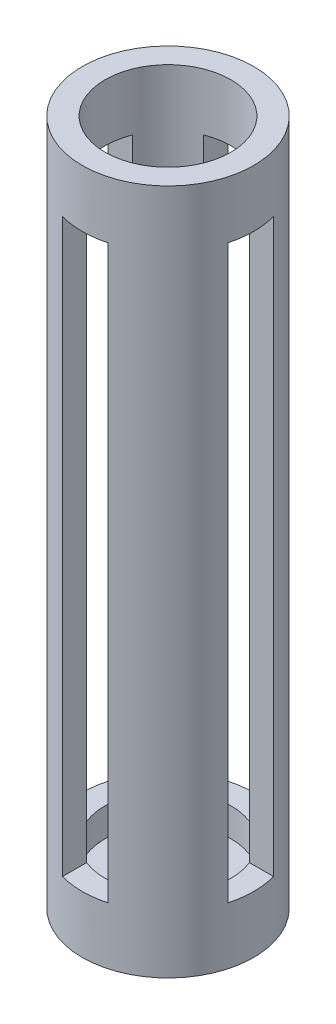
ISO-10303-21;
HEADER;
FILE_DESCRIPTION(('STEP AP214'),'2;1');
FILE_NAME('part.step','',(''),(''),'','','');
FILE_SCHEMA(('AUTOMOTIVE_DESIGN { 1 0 10303 214 1 1 1 1 }'));
ENDSEC;
DATA;
#1=APPLICATION_CONTEXT('core data for automotive mechanical design processes');
#2=APPLICATION_PROTOCOL_DEFINITION('international standard','automotive_design',2000,#1);
#3=PRODUCT_CONTEXT('',#1,'mechanical');
#4=PRODUCT('Part','Part','',(#3));
#5=PRODUCT_RELATED_PRODUCT_CATEGORY('part','',(#4));
#6=PRODUCT_DEFINITION_FORMATION('','',#4);
#7=PRODUCT_DEFINITION_CONTEXT('part definition',#1,'design');
#8=PRODUCT_DEFINITION('design','',#6,#7);
#9=PRODUCT_DEFINITION_SHAPE('','',#8);
#10=(LENGTH_UNIT() NAMED_UNIT(*) SI_UNIT(.MILLI.,.METRE.));
#11=(NAMED_UNIT(*) PLANE_ANGLE_UNIT() SI_UNIT($,.RADIAN.));
#12=(NAMED_UNIT(*) SI_UNIT($,.STERADIAN.) SOLID_ANGLE_UNIT());
#13=UNCERTAINTY_MEASURE_WITH_UNIT(LENGTH_MEASURE(1.E-05),#10,'distance_accuracy_value','');
#14=(GEOMETRIC_REPRESENTATION_CONTEXT(3) GLOBAL_UNCERTAINTY_ASSIGNED_CONTEXT((#13)) GLOBAL_UNIT_ASSIGNED_CONTEXT((#10,
#11,#12)) REPRESENTATION_CONTEXT('',''));
#15=CARTESIAN_POINT('',(0.,0.,0.));
#16=DIRECTION('',(0.,0.,1.));
#17=DIRECTION('',(1.,0.,0.));
#18=AXIS2_PLACEMENT_3D('',#15,#16,#17);
#19=CARTESIAN_POINT('',(0.,6.35,0.));
#20=DIRECTION('',(0.,-1.,0.));
#21=DIRECTION('',(0.,0.,-1.));
#22=AXIS2_PLACEMENT_3D('',#19,#20,#21);
#23=PLANE('',#22);
#24=CARTESIAN_POINT('',(0.,6.35,0.));
#25=DIRECTION('',(0.,-1.,0.));
#26=DIRECTION('',(0.,0.,-1.));
#27=AXIS2_PLACEMENT_3D('',#24,#25,#26);
#28=CIRCLE('',#27,13.97);
#29=CARTESIAN_POINT('',(0.,6.35,-13.97));
#30=VERTEX_POINT('',#29);
#31=EDGE_CURVE('E275',#30,#30,#28,.T.);
#32=ORIENTED_EDGE('',*,*,#31,.F.);
#33=EDGE_LOOP('',(#32));
#34=FACE_BOUND('',#33,.T.);
#35=CARTESIAN_POINT('',(0.,6.35,0.));
#36=DIRECTION('',(0.,-1.,0.));
#37=DIRECTION('',(0.,0.,-1.));
#38=AXIS2_PLACEMENT_3D('',#35,#36,#37);
#39=CIRCLE('',#38,8.89);
#40=CARTESIAN_POINT('',(0.,6.35,-8.89));
#41=VERTEX_POINT('',#40);
#42=EDGE_CURVE('E11',#41,#41,#39,.F.);
#43=ORIENTED_EDGE('',*,*,#42,.F.);
#44=EDGE_LOOP('',(#43));
#45=FACE_BOUND('',#44,.T.);
#46=ADVANCED_FACE('F41',(#34,#45),#23,.F.);
#47=CARTESIAN_POINT('',(0.,152.4,0.));
#48=DIRECTION('',(0.,-1.,0.));
#49=DIRECTION('',(0.,0.,-1.));
#50=AXIS2_PLACEMENT_3D('',#47,#48,#49);
#51=CYLINDRICAL_SURFACE('',#50,19.05);
#52=CARTESIAN_POINT('',(0.,12.7,0.));
#53=DIRECTION('',(0.,1.,0.));
#54=DIRECTION('',(-1.,0.,0.));
#55=AXIS2_PLACEMENT_3D('',#52,#53,#54);
#56=CIRCLE('',#55,19.05);
#57=CARTESIAN_POINT('',(5.08000000000003,12.7,-18.3601770143972));
#58=VERTEX_POINT('',#57);
#59=CARTESIAN_POINT('',(-5.08000000000003,12.7,-18.3601770143972));
#60=VERTEX_POINT('',#59);
#61=EDGE_CURVE('E222',#58,#60,#56,.T.);
#62=ORIENTED_EDGE('',*,*,#61,.F.);
#63=DIRECTION('',(0.,-1.,0.));
#64=VECTOR('',#63,1.);
#65=CARTESIAN_POINT('',(5.07999999999998,152.4,-18.3601770143972));
#66=LINE('',#65,#64);
#67=CARTESIAN_POINT('',(5.07999999999998,139.7,-18.3601770143972));
#68=VERTEX_POINT('',#67);
#69=EDGE_CURVE('E192',#58,#68,#66,.F.);
#70=ORIENTED_EDGE('',*,*,#69,.T.);
#71=CARTESIAN_POINT('',(0.,139.7,0.));
#72=DIRECTION('',(0.,1.,0.));
#73=DIRECTION('',(0.,0.,1.));
#74=AXIS2_PLACEMENT_3D('',#71,#72,#73);
#75=CIRCLE('',#74,19.05);
#76=CARTESIAN_POINT('',(-5.08000000000001,139.7,-18.3601770143972));
#77=VERTEX_POINT('',#76);
#78=EDGE_CURVE('E57',#68,#77,#75,.T.);
#79=ORIENTED_EDGE('',*,*,#78,.T.);
#80=DIRECTION('',(0.,-1.,0.));
#81=VECTOR('',#80,1.);
#82=CARTESIAN_POINT('',(-5.08000000000001,152.4,-18.3601770143972));
#83=LINE('',#82,#81);
#84=EDGE_CURVE('E171',#60,#77,#83,.F.);
#85=ORIENTED_EDGE('',*,*,#84,.F.);
#86=EDGE_LOOP('',(#62,#70,#79,#85));
#87=FACE_BOUND('',#86,.T.);
#88=CARTESIAN_POINT('',(0.,12.7,0.));
#89=DIRECTION('',(0.,1.,0.));
#90=DIRECTION('',(0.,0.,1.));
#91=AXIS2_PLACEMENT_3D('',#88,#89,#90);
#92=CIRCLE('',#91,19.05);
#93=CARTESIAN_POINT('',(18.3601770143972,12.7,5.08));
#94=VERTEX_POINT('',#93);
#95=CARTESIAN_POINT('',(18.3601770143972,12.7,-5.08));
#96=VERTEX_POINT('',#95);
#97=EDGE_CURVE('E295',#94,#96,#92,.T.);
#98=ORIENTED_EDGE('',*,*,#97,.F.);
#99=DIRECTION('',(0.,-1.,0.));
#100=VECTOR('',#99,1.);
#101=CARTESIAN_POINT('',(18.3601770143972,152.4,5.08));
#102=LINE('',#101,#100);
#103=CARTESIAN_POINT('',(18.3601770143972,139.7,5.08));
#104=VERTEX_POINT('',#103);
#105=EDGE_CURVE('E312',#104,#94,#102,.T.);
#106=ORIENTED_EDGE('',*,*,#105,.F.);
#107=CARTESIAN_POINT('',(0.,139.7,0.));
#108=DIRECTION('',(0.,1.,0.));
#109=DIRECTION('',(0.,0.,1.));
#110=AXIS2_PLACEMENT_3D('',#107,#108,#109);
#111=CIRCLE('',#110,19.05);
#112=CARTESIAN_POINT('',(18.3601770143972,139.7,-5.08));
#113=VERTEX_POINT('',#112);
#114=EDGE_CURVE('E288',#104,#113,#111,.T.);
#115=ORIENTED_EDGE('',*,*,#114,.T.);
#116=DIRECTION('',(0.,-1.,0.));
#117=VECTOR('',#116,1.);
#118=CARTESIAN_POINT('',(18.3601770143972,152.4,-5.08));
#119=LINE('',#118,#117);
#120=EDGE_CURVE('E299',#113,#96,#119,.T.);
#121=ORIENTED_EDGE('',*,*,#120,.T.);
#122=EDGE_LOOP('',(#98,#106,#115,#121));
#123=FACE_BOUND('',#122,.T.);
#124=CARTESIAN_POINT('',(0.,0.,0.));
#125=DIRECTION('',(0.,1.,0.));
#126=DIRECTION('',(0.,0.,1.));
#127=AXIS2_PLACEMENT_3D('',#124,#125,#126);
#128=CIRCLE('',#127,19.05);
#129=CARTESIAN_POINT('',(0.,0.,19.05));
#130=VERTEX_POINT('',#129);
#131=EDGE_CURVE('E283',#130,#130,#128,.T.);
#132=ORIENTED_EDGE('',*,*,#131,.T.);
#133=EDGE_LOOP('',(#132));
#134=FACE_BOUND('',#133,.T.);
#135=CARTESIAN_POINT('',(0.,152.4,0.));
#136=DIRECTION('',(0.,1.,0.));
#137=DIRECTION('',(0.,0.,1.));
#138=AXIS2_PLACEMENT_3D('',#135,#136,#137);
#139=CIRCLE('',#138,19.05);
#140=CARTESIAN_POINT('',(0.,152.4,19.05));
#141=VERTEX_POINT('',#140);
#142=EDGE_CURVE('E284',#141,#141,#139,.T.);
#143=ORIENTED_EDGE('',*,*,#142,.F.);
#144=EDGE_LOOP('',(#143));
#145=FACE_BOUND('',#144,.T.);
#146=DIRECTION('',(0.,-1.,0.));
#147=VECTOR('',#146,1.);
#148=CARTESIAN_POINT('',(-18.3601770143972,152.4,-5.08));
#149=LINE('',#148,#147);
#150=CARTESIAN_POINT('',(-18.3601770143972,12.7,-5.08));
#151=VERTEX_POINT('',#150);
#152=CARTESIAN_POINT('',(-18.3601770143972,139.7,-5.08));
#153=VERTEX_POINT('',#152);
#154=EDGE_CURVE('E308',#151,#153,#149,.F.);
#155=ORIENTED_EDGE('',*,*,#154,.T.);
#156=CARTESIAN_POINT('',(-18.3601770143972,139.7,5.08));
#157=VERTEX_POINT('',#156);
#158=EDGE_CURVE('E296',#153,#157,#111,.T.);
#159=ORIENTED_EDGE('',*,*,#158,.T.);
#160=DIRECTION('',(0.,-1.,0.));
#161=VECTOR('',#160,1.);
#162=CARTESIAN_POINT('',(-18.3601770143972,152.4,5.08));
#163=LINE('',#162,#161);
#164=CARTESIAN_POINT('',(-18.3601770143972,12.7,5.08));
#165=VERTEX_POINT('',#164);
#166=EDGE_CURVE('E304',#165,#157,#163,.F.);
#167=ORIENTED_EDGE('',*,*,#166,.F.);
#168=EDGE_CURVE('E300',#151,#165,#92,.T.);
#169=ORIENTED_EDGE('',*,*,#168,.F.);
#170=EDGE_LOOP('',(#155,#159,#167,#169));
#171=FACE_BOUND('',#170,.T.);
#172=CARTESIAN_POINT('',(-5.08000000000003,12.7,18.3601770143972));
#173=VERTEX_POINT('',#172);
#174=CARTESIAN_POINT('',(5.08000000000003,12.7,18.3601770143972));
#175=VERTEX_POINT('',#174);
#176=EDGE_CURVE('E223',#173,#175,#56,.T.);
#177=ORIENTED_EDGE('',*,*,#176,.F.);
#178=DIRECTION('',(0.,-1.,0.));
#179=VECTOR('',#178,1.);
#180=CARTESIAN_POINT('',(-5.08000000000001,152.4,18.3601770143972));
#181=LINE('',#180,#179);
#182=CARTESIAN_POINT('',(-5.08000000000001,139.7,18.3601770143972));
#183=VERTEX_POINT('',#182);
#184=EDGE_CURVE('E219',#183,#173,#181,.T.);
#185=ORIENTED_EDGE('',*,*,#184,.F.);
#186=CARTESIAN_POINT('',(5.07999999999998,139.7,18.3601770143972));
#187=VERTEX_POINT('',#186);
#188=EDGE_CURVE('E196',#183,#187,#75,.T.);
#189=ORIENTED_EDGE('',*,*,#188,.T.);
#190=DIRECTION('',(0.,-1.,0.));
#191=VECTOR('',#190,1.);
#192=CARTESIAN_POINT('',(5.07999999999998,152.4,18.3601770143972));
#193=LINE('',#192,#191);
#194=EDGE_CURVE('E228',#187,#175,#193,.T.);
#195=ORIENTED_EDGE('',*,*,#194,.T.);
#196=EDGE_LOOP('',(#177,#185,#189,#195));
#197=FACE_BOUND('',#196,.T.);
#198=ADVANCED_FACE('F43',(#87,#123,#134,#145,#171,#197),#51,.T.);
#199=CARTESIAN_POINT('',(0.,152.4,0.));
#200=DIRECTION('',(0.,-1.,0.));
#201=DIRECTION('',(0.,0.,-1.));
#202=AXIS2_PLACEMENT_3D('',#199,#200,#201);
#203=CYLINDRICAL_SURFACE('',#202,13.97);
#204=DIRECTION('',(0.,-1.,0.));
#205=VECTOR('',#204,1.);
#206=CARTESIAN_POINT('',(5.07999999999998,152.4,-13.0136274727687));
#207=LINE('',#206,#205);
#208=CARTESIAN_POINT('',(5.08000000000003,12.7,-13.0136274727687));
#209=VERTEX_POINT('',#208);
#210=CARTESIAN_POINT('',(5.07999999999998,139.7,-13.0136274727687));
#211=VERTEX_POINT('',#210);
#212=EDGE_CURVE('E50',#209,#211,#207,.F.);
#213=ORIENTED_EDGE('',*,*,#212,.F.);
#214=CARTESIAN_POINT('',(0.,12.7,0.));
#215=DIRECTION('',(0.,1.,0.));
#216=DIRECTION('',(-1.,0.,0.));
#217=AXIS2_PLACEMENT_3D('',#214,#215,#216);
#218=CIRCLE('',#217,13.97);
#219=CARTESIAN_POINT('',(-5.08000000000003,12.7,-13.0136274727687));
#220=VERTEX_POINT('',#219);
#221=EDGE_CURVE('E179',#209,#220,#218,.T.);
#222=ORIENTED_EDGE('',*,*,#221,.T.);
#223=DIRECTION('',(0.,-1.,0.));
#224=VECTOR('',#223,1.);
#225=CARTESIAN_POINT('',(-5.08000000000001,152.4,-13.0136274727687));
#226=LINE('',#225,#224);
#227=CARTESIAN_POINT('',(-5.08000000000001,139.7,-13.0136274727687));
#228=VERTEX_POINT('',#227);
#229=EDGE_CURVE('E163',#220,#228,#226,.F.);
#230=ORIENTED_EDGE('',*,*,#229,.T.);
#231=CARTESIAN_POINT('',(0.,139.7,0.));
#232=DIRECTION('',(0.,1.,0.));
#233=DIRECTION('',(0.,0.,1.));
#234=AXIS2_PLACEMENT_3D('',#231,#232,#233);
#235=CIRCLE('',#234,13.97);
#236=EDGE_CURVE('E154',#211,#228,#235,.T.);
#237=ORIENTED_EDGE('',*,*,#236,.F.);
#238=EDGE_LOOP('',(#213,#222,#230,#237));
#239=FACE_BOUND('',#238,.T.);
#240=DIRECTION('',(0.,-1.,0.));
#241=VECTOR('',#240,1.);
#242=CARTESIAN_POINT('',(5.07999999999998,152.4,13.0136274727687));
#243=LINE('',#242,#241);
#244=CARTESIAN_POINT('',(5.07999999999998,139.7,13.0136274727687));
#245=VERTEX_POINT('',#244);
#246=CARTESIAN_POINT('',(5.08000000000003,12.7,13.0136274727687));
#247=VERTEX_POINT('',#246);
#248=EDGE_CURVE('E164',#245,#247,#243,.T.);
#249=ORIENTED_EDGE('',*,*,#248,.F.);
#250=CARTESIAN_POINT('',(-5.08000000000001,139.7,13.0136274727687));
#251=VERTEX_POINT('',#250);
#252=EDGE_CURVE('E166',#251,#245,#235,.T.);
#253=ORIENTED_EDGE('',*,*,#252,.F.);
#254=DIRECTION('',(0.,-1.,0.));
#255=VECTOR('',#254,1.);
#256=CARTESIAN_POINT('',(-5.08000000000001,152.4,13.0136274727687));
#257=LINE('',#256,#255);
#258=CARTESIAN_POINT('',(-5.08000000000003,12.7,13.0136274727687));
#259=VERTEX_POINT('',#258);
#260=EDGE_CURVE('E317',#251,#259,#257,.T.);
#261=ORIENTED_EDGE('',*,*,#260,.T.);
#262=EDGE_CURVE('E184',#259,#247,#218,.T.);
#263=ORIENTED_EDGE('',*,*,#262,.T.);
#264=EDGE_LOOP('',(#249,#253,#261,#263));
#265=FACE_BOUND('',#264,.T.);
#266=DIRECTION('',(0.,-1.,0.));
#267=VECTOR('',#266,1.);
#268=CARTESIAN_POINT('',(13.0136274727687,152.4,-5.08));
#269=LINE('',#268,#267);
#270=CARTESIAN_POINT('',(13.0136274727687,139.7,-5.08));
#271=VERTEX_POINT('',#270);
#272=CARTESIAN_POINT('',(13.0136274727687,12.7,-5.08));
#273=VERTEX_POINT('',#272);
#274=EDGE_CURVE('E272',#271,#273,#269,.T.);
#275=ORIENTED_EDGE('',*,*,#274,.F.);
#276=CARTESIAN_POINT('',(0.,139.7,0.));
#277=DIRECTION('',(0.,1.,0.));
#278=DIRECTION('',(0.,0.,1.));
#279=AXIS2_PLACEMENT_3D('',#276,#277,#278);
#280=CIRCLE('',#279,13.97);
#281=CARTESIAN_POINT('',(13.0136274727687,139.7,5.08));
#282=VERTEX_POINT('',#281);
#283=EDGE_CURVE('E254',#282,#271,#280,.T.);
#284=ORIENTED_EDGE('',*,*,#283,.F.);
#285=DIRECTION('',(0.,-1.,0.));
#286=VECTOR('',#285,1.);
#287=CARTESIAN_POINT('',(13.0136274727687,152.4,5.08));
#288=LINE('',#287,#286);
#289=CARTESIAN_POINT('',(13.0136274727687,12.7,5.08));
#290=VERTEX_POINT('',#289);
#291=EDGE_CURVE('E259',#282,#290,#288,.T.);
#292=ORIENTED_EDGE('',*,*,#291,.T.);
#293=CARTESIAN_POINT('',(0.,12.7,0.));
#294=DIRECTION('',(0.,1.,0.));
#295=DIRECTION('',(0.,0.,1.));
#296=AXIS2_PLACEMENT_3D('',#293,#294,#295);
#297=CIRCLE('',#296,13.97);
#298=EDGE_CURVE('E267',#290,#273,#297,.T.);
#299=ORIENTED_EDGE('',*,*,#298,.T.);
#300=EDGE_LOOP('',(#275,#284,#292,#299));
#301=FACE_BOUND('',#300,.T.);
#302=DIRECTION('',(0.,-1.,0.));
#303=VECTOR('',#302,1.);
#304=CARTESIAN_POINT('',(-13.0136274727687,152.4,-5.08));
#305=LINE('',#304,#303);
#306=CARTESIAN_POINT('',(-13.0136274727687,12.7,-5.08));
#307=VERTEX_POINT('',#306);
#308=CARTESIAN_POINT('',(-13.0136274727687,139.7,-5.08));
#309=VERTEX_POINT('',#308);
#310=EDGE_CURVE('E268',#307,#309,#305,.F.);
#311=ORIENTED_EDGE('',*,*,#310,.F.);
#312=CARTESIAN_POINT('',(-13.0136274727687,12.7,5.08));
#313=VERTEX_POINT('',#312);
#314=EDGE_CURVE('E263',#307,#313,#297,.T.);
#315=ORIENTED_EDGE('',*,*,#314,.T.);
#316=DIRECTION('',(0.,-1.,0.));
#317=VECTOR('',#316,1.);
#318=CARTESIAN_POINT('',(-13.0136274727687,152.4,5.08));
#319=LINE('',#318,#317);
#320=CARTESIAN_POINT('',(-13.0136274727687,139.7,5.08));
#321=VERTEX_POINT('',#320);
#322=EDGE_CURVE('E255',#313,#321,#319,.F.);
#323=ORIENTED_EDGE('',*,*,#322,.T.);
#324=EDGE_CURVE('E251',#309,#321,#280,.T.);
#325=ORIENTED_EDGE('',*,*,#324,.F.);
#326=EDGE_LOOP('',(#311,#315,#323,#325));
#327=FACE_BOUND('',#326,.T.);
#328=CARTESIAN_POINT('',(0.,152.4,0.));
#329=DIRECTION('',(0.,1.,0.));
#330=DIRECTION('',(0.,0.,1.));
#331=AXIS2_PLACEMENT_3D('',#328,#329,#330);
#332=CIRCLE('',#331,13.97);
#333=CARTESIAN_POINT('',(0.,152.4,13.97));
#334=VERTEX_POINT('',#333);
#335=EDGE_CURVE('E279',#334,#334,#332,.T.);
#336=ORIENTED_EDGE('',*,*,#335,.T.);
#337=EDGE_LOOP('',(#336));
#338=FACE_BOUND('',#337,.T.);
#339=ORIENTED_EDGE('',*,*,#31,.T.);
#340=EDGE_LOOP('',(#339));
#341=FACE_BOUND('',#340,.T.);
#342=ADVANCED_FACE('F177',(#239,#265,#301,#327,#338,#341),#203,.F.);
#343=CARTESIAN_POINT('',(0.,152.4,0.));
#344=DIRECTION('',(0.,1.,0.));
#345=DIRECTION('',(0.,0.,1.));
#346=AXIS2_PLACEMENT_3D('',#343,#344,#345);
#347=PLANE('',#346);
#348=ORIENTED_EDGE('',*,*,#142,.T.);
#349=EDGE_LOOP('',(#348));
#350=FACE_BOUND('',#349,.T.);
#351=ORIENTED_EDGE('',*,*,#335,.F.);
#352=EDGE_LOOP('',(#351));
#353=FACE_BOUND('',#352,.T.);
#354=ADVANCED_FACE('F367',(#350,#353),#347,.T.);
#355=CARTESIAN_POINT('',(0.,0.,0.));
#356=DIRECTION('',(0.,1.,0.));
#357=DIRECTION('',(0.,0.,1.));
#358=AXIS2_PLACEMENT_3D('',#355,#356,#357);
#359=PLANE('',#358);
#360=CARTESIAN_POINT('',(0.,0.,0.));
#361=DIRECTION('',(0.,1.,0.));
#362=DIRECTION('',(0.,0.,1.));
#363=AXIS2_PLACEMENT_3D('',#360,#361,#362);
#364=CIRCLE('',#363,6.35);
#365=CARTESIAN_POINT('',(0.,0.,6.35));
#366=VERTEX_POINT('',#365);
#367=EDGE_CURVE('E206',#366,#366,#364,.T.);
#368=ORIENTED_EDGE('',*,*,#367,.T.);
#369=EDGE_LOOP('',(#368));
#370=FACE_BOUND('',#369,.T.);
#371=ORIENTED_EDGE('',*,*,#131,.F.);
#372=EDGE_LOOP('',(#371));
#373=FACE_BOUND('',#372,.T.);
#374=ADVANCED_FACE('F369',(#370,#373),#359,.F.);
#375=CARTESIAN_POINT('',(-19.05,139.7,0.));
#376=DIRECTION('',(0.,1.,0.));
#377=DIRECTION('',(0.,0.,1.));
#378=AXIS2_PLACEMENT_3D('',#375,#376,#377);
#379=PLANE('',#378);
#380=ORIENTED_EDGE('',*,*,#324,.T.);
#381=DIRECTION('',(1.,0.,0.));
#382=VECTOR('',#381,1.);
#383=CARTESIAN_POINT('',(-19.05,139.7,5.08));
#384=LINE('',#383,#382);
#385=EDGE_CURVE('E243',#157,#321,#384,.T.);
#386=ORIENTED_EDGE('',*,*,#385,.F.);
#387=ORIENTED_EDGE('',*,*,#158,.F.);
#388=DIRECTION('',(1.,0.,0.));
#389=VECTOR('',#388,1.);
#390=CARTESIAN_POINT('',(-19.05,139.7,-5.08));
#391=LINE('',#390,#389);
#392=EDGE_CURVE('E248',#153,#309,#391,.T.);
#393=ORIENTED_EDGE('',*,*,#392,.T.);
#394=EDGE_LOOP('',(#380,#386,#387,#393));
#395=FACE_BOUND('',#394,.T.);
#396=ADVANCED_FACE('F372',(#395),#379,.F.);
#397=CARTESIAN_POINT('',(-19.05,0.,5.08));
#398=DIRECTION('',(0.,0.,-1.));
#399=DIRECTION('',(-1.,0.,0.));
#400=AXIS2_PLACEMENT_3D('',#397,#398,#399);
#401=PLANE('',#400);
#402=DIRECTION('',(1.,0.,0.));
#403=VECTOR('',#402,1.);
#404=CARTESIAN_POINT('',(-19.05,12.7,5.08));
#405=LINE('',#404,#403);
#406=EDGE_CURVE('E238',#165,#313,#405,.T.);
#407=ORIENTED_EDGE('',*,*,#406,.F.);
#408=ORIENTED_EDGE('',*,*,#166,.T.);
#409=ORIENTED_EDGE('',*,*,#385,.T.);
#410=ORIENTED_EDGE('',*,*,#322,.F.);
#411=EDGE_LOOP('',(#407,#408,#409,#410));
#412=FACE_BOUND('',#411,.T.);
#413=ADVANCED_FACE('F377',(#412),#401,.T.);
#414=CARTESIAN_POINT('',(-19.05,12.7,0.));
#415=DIRECTION('',(0.,1.,0.));
#416=DIRECTION('',(0.,0.,1.));
#417=AXIS2_PLACEMENT_3D('',#414,#415,#416);
#418=PLANE('',#417);
#419=DIRECTION('',(1.,0.,0.));
#420=VECTOR('',#419,1.);
#421=CARTESIAN_POINT('',(-19.05,12.7,-5.08));
#422=LINE('',#421,#420);
#423=EDGE_CURVE('E237',#151,#307,#422,.T.);
#424=ORIENTED_EDGE('',*,*,#423,.F.);
#425=ORIENTED_EDGE('',*,*,#168,.T.);
#426=ORIENTED_EDGE('',*,*,#406,.T.);
#427=ORIENTED_EDGE('',*,*,#314,.F.);
#428=EDGE_LOOP('',(#424,#425,#426,#427));
#429=FACE_BOUND('',#428,.T.);
#430=ADVANCED_FACE('F397',(#429),#418,.T.);
#431=CARTESIAN_POINT('',(-19.05,0.,-5.08));
#432=DIRECTION('',(0.,0.,-1.));
#433=DIRECTION('',(-1.,0.,0.));
#434=AXIS2_PLACEMENT_3D('',#431,#432,#433);
#435=PLANE('',#434);
#436=ORIENTED_EDGE('',*,*,#310,.T.);
#437=ORIENTED_EDGE('',*,*,#392,.F.);
#438=ORIENTED_EDGE('',*,*,#154,.F.);
#439=ORIENTED_EDGE('',*,*,#423,.T.);
#440=EDGE_LOOP('',(#436,#437,#438,#439));
#441=FACE_BOUND('',#440,.T.);
#442=ADVANCED_FACE('F394',(#441),#435,.F.);
#443=ORIENTED_EDGE('',*,*,#274,.T.);
#444=EDGE_CURVE('E233',#273,#96,#422,.T.);
#445=ORIENTED_EDGE('',*,*,#444,.T.);
#446=ORIENTED_EDGE('',*,*,#120,.F.);
#447=EDGE_CURVE('E232',#271,#113,#391,.T.);
#448=ORIENTED_EDGE('',*,*,#447,.F.);
#449=EDGE_LOOP('',(#443,#445,#446,#448));
#450=FACE_BOUND('',#449,.T.);
#451=ADVANCED_FACE('F363',(#450),#435,.F.);
#452=EDGE_CURVE('E239',#290,#94,#405,.T.);
#453=ORIENTED_EDGE('',*,*,#452,.T.);
#454=ORIENTED_EDGE('',*,*,#97,.T.);
#455=ORIENTED_EDGE('',*,*,#444,.F.);
#456=ORIENTED_EDGE('',*,*,#298,.F.);
#457=EDGE_LOOP('',(#453,#454,#455,#456));
#458=FACE_BOUND('',#457,.T.);
#459=ADVANCED_FACE('F418',(#458),#418,.T.);
#460=EDGE_CURVE('E244',#282,#104,#384,.T.);
#461=ORIENTED_EDGE('',*,*,#460,.T.);
#462=ORIENTED_EDGE('',*,*,#105,.T.);
#463=ORIENTED_EDGE('',*,*,#452,.F.);
#464=ORIENTED_EDGE('',*,*,#291,.F.);
#465=EDGE_LOOP('',(#461,#462,#463,#464));
#466=FACE_BOUND('',#465,.T.);
#467=ADVANCED_FACE('F416',(#466),#401,.T.);
#468=ORIENTED_EDGE('',*,*,#283,.T.);
#469=ORIENTED_EDGE('',*,*,#447,.T.);
#470=ORIENTED_EDGE('',*,*,#114,.F.);
#471=ORIENTED_EDGE('',*,*,#460,.F.);
#472=EDGE_LOOP('',(#468,#469,#470,#471));
#473=FACE_BOUND('',#472,.T.);
#474=ADVANCED_FACE('F350',(#473),#379,.F.);
#475=CARTESIAN_POINT('',(0.,139.7,-19.05));
#476=DIRECTION('',(0.,1.,0.));
#477=DIRECTION('',(0.,0.,1.));
#478=AXIS2_PLACEMENT_3D('',#475,#476,#477);
#479=PLANE('',#478);
#480=ORIENTED_EDGE('',*,*,#188,.F.);
#481=DIRECTION('',(0.,0.,1.));
#482=VECTOR('',#481,1.);
#483=CARTESIAN_POINT('',(-5.08000000000002,139.7,-19.05));
#484=LINE('',#483,#482);
#485=EDGE_CURVE('E174',#251,#183,#484,.T.);
#486=ORIENTED_EDGE('',*,*,#485,.F.);
#487=ORIENTED_EDGE('',*,*,#252,.T.);
#488=DIRECTION('',(0.,0.,1.));
#489=VECTOR('',#488,1.);
#490=CARTESIAN_POINT('',(5.07999999999998,139.7,-19.05));
#491=LINE('',#490,#489);
#492=EDGE_CURVE('E213',#245,#187,#491,.T.);
#493=ORIENTED_EDGE('',*,*,#492,.T.);
#494=EDGE_LOOP('',(#480,#486,#487,#493));
#495=FACE_BOUND('',#494,.T.);
#496=ADVANCED_FACE('F337',(#495),#479,.F.);
#497=CARTESIAN_POINT('',(-5.08000000000003,0.,-19.05));
#498=DIRECTION('',(1.,0.,0.));
#499=DIRECTION('',(0.,1.,0.));
#500=AXIS2_PLACEMENT_3D('',#497,#498,#499);
#501=PLANE('',#500);
#502=ORIENTED_EDGE('',*,*,#184,.T.);
#503=DIRECTION('',(0.,0.,1.));
#504=VECTOR('',#503,1.);
#505=CARTESIAN_POINT('',(-5.08000000000003,12.7,-19.05));
#506=LINE('',#505,#504);
#507=EDGE_CURVE('E173',#259,#173,#506,.T.);
#508=ORIENTED_EDGE('',*,*,#507,.F.);
#509=ORIENTED_EDGE('',*,*,#260,.F.);
#510=ORIENTED_EDGE('',*,*,#485,.T.);
#511=EDGE_LOOP('',(#502,#508,#509,#510));
#512=FACE_BOUND('',#511,.T.);
#513=ADVANCED_FACE('F341',(#512),#501,.T.);
#514=CARTESIAN_POINT('',(0.,12.7,-19.05));
#515=DIRECTION('',(0.,1.,0.));
#516=DIRECTION('',(-1.,0.,0.));
#517=AXIS2_PLACEMENT_3D('',#514,#515,#516);
#518=PLANE('',#517);
#519=ORIENTED_EDGE('',*,*,#176,.T.);
#520=DIRECTION('',(0.,0.,1.));
#521=VECTOR('',#520,1.);
#522=CARTESIAN_POINT('',(5.08000000000003,12.7,-19.05));
#523=LINE('',#522,#521);
#524=EDGE_CURVE('E197',#247,#175,#523,.T.);
#525=ORIENTED_EDGE('',*,*,#524,.F.);
#526=ORIENTED_EDGE('',*,*,#262,.F.);
#527=ORIENTED_EDGE('',*,*,#507,.T.);
#528=EDGE_LOOP('',(#519,#525,#526,#527));
#529=FACE_BOUND('',#528,.T.);
#530=ADVANCED_FACE('F331',(#529),#518,.T.);
#531=CARTESIAN_POINT('',(5.08000000000004,0.,-19.05));
#532=DIRECTION('',(1.,0.,0.));
#533=DIRECTION('',(0.,1.,0.));
#534=AXIS2_PLACEMENT_3D('',#531,#532,#533);
#535=PLANE('',#534);
#536=ORIENTED_EDGE('',*,*,#492,.F.);
#537=ORIENTED_EDGE('',*,*,#248,.T.);
#538=ORIENTED_EDGE('',*,*,#524,.T.);
#539=ORIENTED_EDGE('',*,*,#194,.F.);
#540=EDGE_LOOP('',(#536,#537,#538,#539));
#541=FACE_BOUND('',#540,.T.);
#542=ADVANCED_FACE('F327',(#541),#535,.F.);
#543=EDGE_CURVE('E191',#58,#209,#523,.T.);
#544=ORIENTED_EDGE('',*,*,#543,.T.);
#545=ORIENTED_EDGE('',*,*,#212,.T.);
#546=EDGE_CURVE('E64',#68,#211,#491,.T.);
#547=ORIENTED_EDGE('',*,*,#546,.F.);
#548=ORIENTED_EDGE('',*,*,#69,.F.);
#549=EDGE_LOOP('',(#544,#545,#547,#548));
#550=FACE_BOUND('',#549,.T.);
#551=ADVANCED_FACE('F189',(#550),#535,.F.);
#552=ORIENTED_EDGE('',*,*,#61,.T.);
#553=EDGE_CURVE('E203',#60,#220,#506,.T.);
#554=ORIENTED_EDGE('',*,*,#553,.T.);
#555=ORIENTED_EDGE('',*,*,#221,.F.);
#556=ORIENTED_EDGE('',*,*,#543,.F.);
#557=EDGE_LOOP('',(#552,#554,#555,#556));
#558=FACE_BOUND('',#557,.T.);
#559=ADVANCED_FACE('F349',(#558),#518,.T.);
#560=ORIENTED_EDGE('',*,*,#84,.T.);
#561=EDGE_CURVE('E157',#77,#228,#484,.T.);
#562=ORIENTED_EDGE('',*,*,#561,.T.);
#563=ORIENTED_EDGE('',*,*,#229,.F.);
#564=ORIENTED_EDGE('',*,*,#553,.F.);
#565=EDGE_LOOP('',(#560,#562,#563,#564));
#566=FACE_BOUND('',#565,.T.);
#567=ADVANCED_FACE('F168',(#566),#501,.T.);
#568=ORIENTED_EDGE('',*,*,#546,.T.);
#569=ORIENTED_EDGE('',*,*,#236,.T.);
#570=ORIENTED_EDGE('',*,*,#561,.F.);
#571=ORIENTED_EDGE('',*,*,#78,.F.);
#572=EDGE_LOOP('',(#568,#569,#570,#571));
#573=FACE_BOUND('',#572,.T.);
#574=ADVANCED_FACE('F156',(#573),#479,.F.);
#575=CARTESIAN_POINT('',(0.,0.,0.));
#576=DIRECTION('',(0.,1.,0.));
#577=DIRECTION('',(0.,0.,1.));
#578=AXIS2_PLACEMENT_3D('',#575,#576,#577);
#579=CYLINDRICAL_SURFACE('',#578,6.35);
#580=ORIENTED_EDGE('',*,*,#367,.F.);
#581=EDGE_LOOP('',(#580));
#582=FACE_BOUND('',#581,.T.);
#583=CARTESIAN_POINT('',(0.,25.4,0.));
#584=DIRECTION('',(0.,1.,0.));
#585=DIRECTION('',(0.,0.,1.));
#586=AXIS2_PLACEMENT_3D('',#583,#584,#585);
#587=CIRCLE('',#586,6.35);
#588=CARTESIAN_POINT('',(0.,25.4,6.35));
#589=VERTEX_POINT('',#588);
#590=EDGE_CURVE('E492',#589,#589,#587,.T.);
#591=ORIENTED_EDGE('',*,*,#590,.T.);
#592=EDGE_LOOP('',(#591));
#593=FACE_BOUND('',#592,.T.);
#594=ADVANCED_FACE('F450',(#582,#593),#579,.F.);
#595=CARTESIAN_POINT('',(0.,25.4,0.));
#596=DIRECTION('',(0.,-1.,0.));
#597=DIRECTION('',(0.,0.,-1.));
#598=AXIS2_PLACEMENT_3D('',#595,#596,#597);
#599=CYLINDRICAL_SURFACE('',#598,8.89);
#600=ORIENTED_EDGE('',*,*,#42,.T.);
#601=EDGE_LOOP('',(#600));
#602=FACE_BOUND('',#601,.T.);
#603=CARTESIAN_POINT('',(0.,30.48,0.));
#604=DIRECTION('',(0.,1.,0.));
#605=DIRECTION('',(0.,0.,1.));
#606=AXIS2_PLACEMENT_3D('',#603,#604,#605);
#607=CIRCLE('',#606,8.89);
#608=CARTESIAN_POINT('',(0.,30.48,8.89));
#609=VERTEX_POINT('',#608);
#610=EDGE_CURVE('E487',#609,#609,#607,.T.);
#611=ORIENTED_EDGE('',*,*,#610,.F.);
#612=EDGE_LOOP('',(#611));
#613=FACE_BOUND('',#612,.T.);
#614=ADVANCED_FACE('F454',(#602,#613),#599,.T.);
#615=CARTESIAN_POINT('',(0.,25.4,0.));
#616=DIRECTION('',(0.,1.,0.));
#617=DIRECTION('',(0.,0.,1.));
#618=AXIS2_PLACEMENT_3D('',#615,#616,#617);
#619=PLANE('',#618);
#620=CARTESIAN_POINT('',(0.,25.4,0.));
#621=DIRECTION('',(0.,1.,0.));
#622=DIRECTION('',(0.,0.,1.));
#623=AXIS2_PLACEMENT_3D('',#620,#621,#622);
#624=CIRCLE('',#623,5.08);
#625=CARTESIAN_POINT('',(0.,25.4,5.08));
#626=VERTEX_POINT('',#625);
#627=EDGE_CURVE('E483',#626,#626,#624,.T.);
#628=ORIENTED_EDGE('',*,*,#627,.T.);
#629=EDGE_LOOP('',(#628));
#630=FACE_BOUND('',#629,.T.);
#631=ORIENTED_EDGE('',*,*,#590,.F.);
#632=EDGE_LOOP('',(#631));
#633=FACE_BOUND('',#632,.T.);
#634=ADVANCED_FACE('F460',(#630,#633),#619,.F.);
#635=CARTESIAN_POINT('',(0.,30.48,0.));
#636=DIRECTION('',(0.,1.,0.));
#637=DIRECTION('',(0.,0.,1.));
#638=AXIS2_PLACEMENT_3D('',#635,#636,#637);
#639=PLANE('',#638);
#640=ORIENTED_EDGE('',*,*,#610,.T.);
#641=EDGE_LOOP('',(#640));
#642=FACE_BOUND('',#641,.T.);
#643=CARTESIAN_POINT('',(0.,30.48,0.));
#644=DIRECTION('',(0.,1.,0.));
#645=DIRECTION('',(0.,0.,1.));
#646=AXIS2_PLACEMENT_3D('',#643,#644,#645);
#647=CIRCLE('',#646,5.08);
#648=CARTESIAN_POINT('',(0.,30.48,5.08));
#649=VERTEX_POINT('',#648);
#650=EDGE_CURVE('E480',#649,#649,#647,.T.);
#651=ORIENTED_EDGE('',*,*,#650,.F.);
#652=EDGE_LOOP('',(#651));
#653=FACE_BOUND('',#652,.T.);
#654=ADVANCED_FACE('F467',(#642,#653),#639,.T.);
#655=CARTESIAN_POINT('',(0.,30.48,0.));
#656=DIRECTION('',(0.,-1.,0.));
#657=DIRECTION('',(0.,0.,-1.));
#658=AXIS2_PLACEMENT_3D('',#655,#656,#657);
#659=CYLINDRICAL_SURFACE('',#658,5.08);
#660=ORIENTED_EDGE('',*,*,#650,.T.);
#661=EDGE_LOOP('',(#660));
#662=FACE_BOUND('',#661,.T.);
#663=ORIENTED_EDGE('',*,*,#627,.F.);
#664=EDGE_LOOP('',(#663));
#665=FACE_BOUND('',#664,.T.);
#666=ADVANCED_FACE('F471',(#662,#665),#659,.F.);
#667=CLOSED_SHELL('',(#46,#198,#342,#354,#374,#396,#413,#430,#442,#451,#459,#467,#474,#496,#513,
#530,#542,#551,#559,#567,#574,#594,#614,#634,#654,#666));
#668=MANIFOLD_SOLID_BREP('B2',#667);
#669=ADVANCED_BREP_SHAPE_REPRESENTATION('',(#18,#668),#14);
#670=SHAPE_DEFINITION_REPRESENTATION(#9,#669);
ENDSEC;
END-ISO-10303-21;
